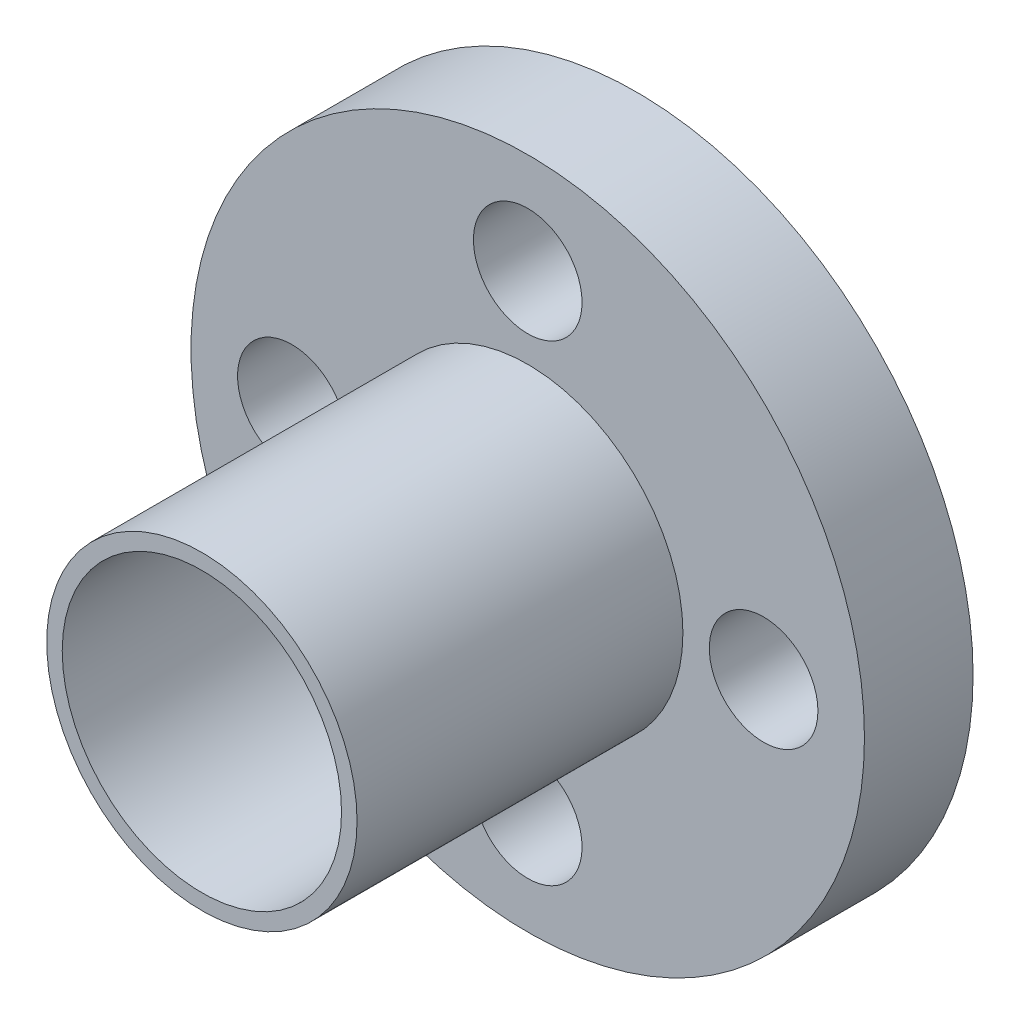
ISO-10303-21;
HEADER;
FILE_DESCRIPTION(('STEP AP214'),'2;1');
FILE_NAME('part.step','',(''),(''),'','','');
FILE_SCHEMA(('AUTOMOTIVE_DESIGN { 1 0 10303 214 1 1 1 1 }'));
ENDSEC;
DATA;
#1=APPLICATION_CONTEXT('core data for automotive mechanical design processes');
#2=APPLICATION_PROTOCOL_DEFINITION('international standard','automotive_design',2000,#1);
#3=PRODUCT_CONTEXT('',#1,'mechanical');
#4=PRODUCT('Part','Part','',(#3));
#5=PRODUCT_RELATED_PRODUCT_CATEGORY('part','',(#4));
#6=PRODUCT_DEFINITION_FORMATION('','',#4);
#7=PRODUCT_DEFINITION_CONTEXT('part definition',#1,'design');
#8=PRODUCT_DEFINITION('design','',#6,#7);
#9=PRODUCT_DEFINITION_SHAPE('','',#8);
#10=(LENGTH_UNIT() NAMED_UNIT(*) SI_UNIT(.MILLI.,.METRE.));
#11=(NAMED_UNIT(*) PLANE_ANGLE_UNIT() SI_UNIT($,.RADIAN.));
#12=(NAMED_UNIT(*) SI_UNIT($,.STERADIAN.) SOLID_ANGLE_UNIT());
#13=UNCERTAINTY_MEASURE_WITH_UNIT(LENGTH_MEASURE(1.E-05),#10,'distance_accuracy_value','');
#14=(GEOMETRIC_REPRESENTATION_CONTEXT(3) GLOBAL_UNCERTAINTY_ASSIGNED_CONTEXT((#13)) GLOBAL_UNIT_ASSIGNED_CONTEXT((#10,
#11,#12)) REPRESENTATION_CONTEXT('',''));
#15=CARTESIAN_POINT('',(0.,0.,0.));
#16=DIRECTION('',(0.,0.,1.));
#17=DIRECTION('',(1.,0.,0.));
#18=AXIS2_PLACEMENT_3D('',#15,#16,#17);
#19=CARTESIAN_POINT('',(0.,0.,15.));
#20=DIRECTION('',(0.,0.,-1.));
#21=DIRECTION('',(-1.,0.,0.));
#22=AXIS2_PLACEMENT_3D('',#19,#20,#21);
#23=CYLINDRICAL_SURFACE('',#22,5.);
#24=CARTESIAN_POINT('',(0.,0.,0.));
#25=DIRECTION('',(0.,0.,1.));
#26=DIRECTION('',(1.,0.,0.));
#27=AXIS2_PLACEMENT_3D('',#24,#25,#26);
#28=CIRCLE('',#27,5.);
#29=CARTESIAN_POINT('',(5.,0.,0.));
#30=VERTEX_POINT('',#29);
#31=EDGE_CURVE('E36',#30,#30,#28,.T.);
#32=ORIENTED_EDGE('',*,*,#31,.T.);
#33=EDGE_LOOP('',(#32));
#34=FACE_BOUND('',#33,.T.);
#35=CARTESIAN_POINT('',(0.,0.,0.999999999999999));
#36=DIRECTION('',(0.,0.,1.));
#37=DIRECTION('',(1.,0.,0.));
#38=AXIS2_PLACEMENT_3D('',#35,#36,#37);
#39=CIRCLE('',#38,5.);
#40=CARTESIAN_POINT('',(5.,0.,0.999999999999999));
#41=VERTEX_POINT('',#40);
#42=EDGE_CURVE('E10',#41,#41,#39,.T.);
#43=ORIENTED_EDGE('',*,*,#42,.F.);
#44=EDGE_LOOP('',(#43));
#45=FACE_BOUND('',#44,.T.);
#46=ADVANCED_FACE('F32',(#34,#45),#23,.T.);
#47=CARTESIAN_POINT('',(0.,0.,0.));
#48=DIRECTION('',(0.,0.,1.));
#49=DIRECTION('',(1.,0.,0.));
#50=AXIS2_PLACEMENT_3D('',#47,#48,#49);
#51=PLANE('',#50);
#52=ORIENTED_EDGE('',*,*,#31,.F.);
#53=EDGE_LOOP('',(#52));
#54=FACE_BOUND('',#53,.T.);
#55=CARTESIAN_POINT('',(0.,0.,0.));
#56=DIRECTION('',(0.,0.,1.));
#57=DIRECTION('',(1.,0.,0.));
#58=AXIS2_PLACEMENT_3D('',#55,#56,#57);
#59=CIRCLE('',#58,4.5);
#60=CARTESIAN_POINT('',(4.5,0.,0.));
#61=VERTEX_POINT('',#60);
#62=EDGE_CURVE('E52',#61,#61,#59,.T.);
#63=ORIENTED_EDGE('',*,*,#62,.T.);
#64=EDGE_LOOP('',(#63));
#65=FACE_BOUND('',#64,.T.);
#66=ADVANCED_FACE('F111',(#54,#65),#51,.F.);
#67=CARTESIAN_POINT('',(0.,0.,0.999999999999999));
#68=DIRECTION('',(0.,0.,1.));
#69=DIRECTION('',(1.,0.,0.));
#70=AXIS2_PLACEMENT_3D('',#67,#68,#69);
#71=CYLINDRICAL_SURFACE('',#70,10.85);
#72=CARTESIAN_POINT('',(0.,0.,0.999999999999999));
#73=DIRECTION('',(0.,0.,1.));
#74=DIRECTION('',(1.,0.,0.));
#75=AXIS2_PLACEMENT_3D('',#72,#73,#74);
#76=CIRCLE('',#75,10.85);
#77=CARTESIAN_POINT('',(10.85,0.,0.999999999999999));
#78=VERTEX_POINT('',#77);
#79=EDGE_CURVE('E57',#78,#78,#76,.T.);
#80=ORIENTED_EDGE('',*,*,#79,.T.);
#81=EDGE_LOOP('',(#80));
#82=FACE_BOUND('',#81,.T.);
#83=CARTESIAN_POINT('',(0.,0.,4.5));
#84=DIRECTION('',(0.,0.,1.));
#85=DIRECTION('',(1.,0.,0.));
#86=AXIS2_PLACEMENT_3D('',#83,#84,#85);
#87=CIRCLE('',#86,10.85);
#88=CARTESIAN_POINT('',(10.85,0.,4.5));
#89=VERTEX_POINT('',#88);
#90=EDGE_CURVE('E61',#89,#89,#87,.T.);
#91=ORIENTED_EDGE('',*,*,#90,.F.);
#92=EDGE_LOOP('',(#91));
#93=FACE_BOUND('',#92,.T.);
#94=ADVANCED_FACE('F109',(#82,#93),#71,.T.);
#95=CARTESIAN_POINT('',(0.,0.,0.999999999999999));
#96=DIRECTION('',(0.,0.,1.));
#97=DIRECTION('',(1.,0.,0.));
#98=AXIS2_PLACEMENT_3D('',#95,#96,#97);
#99=PLANE('',#98);
#100=CARTESIAN_POINT('',(0.,7.6,0.999999999999999));
#101=DIRECTION('',(0.,0.,1.));
#102=DIRECTION('',(1.,0.,0.));
#103=AXIS2_PLACEMENT_3D('',#100,#101,#102);
#104=CIRCLE('',#103,1.75);
#105=CARTESIAN_POINT('',(1.75,7.6,0.999999999999999));
#106=VERTEX_POINT('',#105);
#107=EDGE_CURVE('E66',#106,#106,#104,.T.);
#108=ORIENTED_EDGE('',*,*,#107,.T.);
#109=EDGE_LOOP('',(#108));
#110=FACE_BOUND('',#109,.T.);
#111=CARTESIAN_POINT('',(7.60000000000022,2.15074260103718E-13,0.999999999999999));
#112=DIRECTION('',(0.,0.,1.));
#113=DIRECTION('',(1.,0.,0.));
#114=AXIS2_PLACEMENT_3D('',#111,#112,#113);
#115=CIRCLE('',#114,1.75000000000017);
#116=CARTESIAN_POINT('',(9.35000000000038,2.15074260103718E-13,0.999999999999999));
#117=VERTEX_POINT('',#116);
#118=EDGE_CURVE('E70',#117,#117,#115,.T.);
#119=ORIENTED_EDGE('',*,*,#118,.T.);
#120=EDGE_LOOP('',(#119));
#121=FACE_BOUND('',#120,.T.);
#122=CARTESIAN_POINT('',(4.30148520207437E-13,-7.6,0.999999999999999));
#123=DIRECTION('',(0.,0.,1.));
#124=DIRECTION('',(1.,0.,0.));
#125=AXIS2_PLACEMENT_3D('',#122,#123,#124);
#126=CIRCLE('',#125,1.75000000000046);
#127=CARTESIAN_POINT('',(1.75000000000089,-7.6,0.999999999999999));
#128=VERTEX_POINT('',#127);
#129=EDGE_CURVE('E73',#128,#128,#126,.T.);
#130=ORIENTED_EDGE('',*,*,#129,.T.);
#131=EDGE_LOOP('',(#130));
#132=FACE_BOUND('',#131,.T.);
#133=CARTESIAN_POINT('',(-7.59999999999979,-2.1600499167107E-13,0.999999999999999));
#134=DIRECTION('',(0.,0.,1.));
#135=DIRECTION('',(1.,0.,0.));
#136=AXIS2_PLACEMENT_3D('',#133,#134,#135);
#137=CIRCLE('',#136,1.75000000000035);
#138=CARTESIAN_POINT('',(-5.84999999999944,-2.1600499167107E-13,0.999999999999999));
#139=VERTEX_POINT('',#138);
#140=EDGE_CURVE('E76',#139,#139,#137,.T.);
#141=ORIENTED_EDGE('',*,*,#140,.T.);
#142=EDGE_LOOP('',(#141));
#143=FACE_BOUND('',#142,.T.);
#144=ORIENTED_EDGE('',*,*,#42,.T.);
#145=EDGE_LOOP('',(#144));
#146=FACE_BOUND('',#145,.T.);
#147=ORIENTED_EDGE('',*,*,#79,.F.);
#148=EDGE_LOOP('',(#147));
#149=FACE_BOUND('',#148,.T.);
#150=ADVANCED_FACE('F98',(#110,#121,#132,#143,#146,#149),#99,.F.);
#151=CARTESIAN_POINT('',(0.,0.,4.5));
#152=DIRECTION('',(0.,0.,1.));
#153=DIRECTION('',(1.,0.,0.));
#154=AXIS2_PLACEMENT_3D('',#151,#152,#153);
#155=PLANE('',#154);
#156=CARTESIAN_POINT('',(0.,7.6,4.5));
#157=DIRECTION('',(0.,0.,1.));
#158=DIRECTION('',(1.,0.,0.));
#159=AXIS2_PLACEMENT_3D('',#156,#157,#158);
#160=CIRCLE('',#159,1.75);
#161=CARTESIAN_POINT('',(1.75,7.6,4.5));
#162=VERTEX_POINT('',#161);
#163=EDGE_CURVE('E79',#162,#162,#160,.T.);
#164=ORIENTED_EDGE('',*,*,#163,.F.);
#165=EDGE_LOOP('',(#164));
#166=FACE_BOUND('',#165,.T.);
#167=CARTESIAN_POINT('',(7.60000000000022,2.15074260103718E-13,4.5));
#168=DIRECTION('',(0.,0.,1.));
#169=DIRECTION('',(1.,0.,0.));
#170=AXIS2_PLACEMENT_3D('',#167,#168,#169);
#171=CIRCLE('',#170,1.75000000000017);
#172=CARTESIAN_POINT('',(9.35000000000038,2.15074260103718E-13,4.5));
#173=VERTEX_POINT('',#172);
#174=EDGE_CURVE('E86',#173,#173,#171,.T.);
#175=ORIENTED_EDGE('',*,*,#174,.F.);
#176=EDGE_LOOP('',(#175));
#177=FACE_BOUND('',#176,.T.);
#178=CARTESIAN_POINT('',(4.30148520207437E-13,-7.6,4.5));
#179=DIRECTION('',(0.,0.,1.));
#180=DIRECTION('',(1.,0.,0.));
#181=AXIS2_PLACEMENT_3D('',#178,#179,#180);
#182=CIRCLE('',#181,1.75000000000046);
#183=CARTESIAN_POINT('',(1.75000000000089,-7.6,4.5));
#184=VERTEX_POINT('',#183);
#185=EDGE_CURVE('E83',#184,#184,#182,.T.);
#186=ORIENTED_EDGE('',*,*,#185,.F.);
#187=EDGE_LOOP('',(#186));
#188=FACE_BOUND('',#187,.T.);
#189=CARTESIAN_POINT('',(-7.59999999999979,-2.1600499167107E-13,4.5));
#190=DIRECTION('',(0.,0.,1.));
#191=DIRECTION('',(1.,0.,0.));
#192=AXIS2_PLACEMENT_3D('',#189,#190,#191);
#193=CIRCLE('',#192,1.75000000000035);
#194=CARTESIAN_POINT('',(-5.84999999999944,-2.1600499167107E-13,4.5));
#195=VERTEX_POINT('',#194);
#196=EDGE_CURVE('E80',#195,#195,#193,.T.);
#197=ORIENTED_EDGE('',*,*,#196,.F.);
#198=EDGE_LOOP('',(#197));
#199=FACE_BOUND('',#198,.T.);
#200=CARTESIAN_POINT('',(0.,0.,4.5));
#201=DIRECTION('',(0.,0.,1.));
#202=DIRECTION('',(1.,0.,0.));
#203=AXIS2_PLACEMENT_3D('',#200,#201,#202);
#204=CIRCLE('',#203,5.);
#205=CARTESIAN_POINT('',(5.,0.,4.5));
#206=VERTEX_POINT('',#205);
#207=EDGE_CURVE('E47',#206,#206,#204,.T.);
#208=ORIENTED_EDGE('',*,*,#207,.F.);
#209=EDGE_LOOP('',(#208));
#210=FACE_BOUND('',#209,.T.);
#211=ORIENTED_EDGE('',*,*,#90,.T.);
#212=EDGE_LOOP('',(#211));
#213=FACE_BOUND('',#212,.T.);
#214=ADVANCED_FACE('F95',(#166,#177,#188,#199,#210,#213),#155,.T.);
#215=ORIENTED_EDGE('',*,*,#207,.T.);
#216=EDGE_LOOP('',(#215));
#217=FACE_BOUND('',#216,.T.);
#218=CARTESIAN_POINT('',(0.,0.,15.));
#219=DIRECTION('',(0.,0.,1.));
#220=DIRECTION('',(1.,0.,0.));
#221=AXIS2_PLACEMENT_3D('',#218,#219,#220);
#222=CIRCLE('',#221,5.);
#223=CARTESIAN_POINT('',(5.,0.,15.));
#224=VERTEX_POINT('',#223);
#225=EDGE_CURVE('E40',#224,#224,#222,.T.);
#226=ORIENTED_EDGE('',*,*,#225,.F.);
#227=EDGE_LOOP('',(#226));
#228=FACE_BOUND('',#227,.T.);
#229=ADVANCED_FACE('F34',(#217,#228),#23,.T.);
#230=CARTESIAN_POINT('',(0.,0.,15.));
#231=DIRECTION('',(0.,0.,1.));
#232=DIRECTION('',(1.,0.,0.));
#233=AXIS2_PLACEMENT_3D('',#230,#231,#232);
#234=PLANE('',#233);
#235=ORIENTED_EDGE('',*,*,#225,.T.);
#236=EDGE_LOOP('',(#235));
#237=FACE_BOUND('',#236,.T.);
#238=CARTESIAN_POINT('',(0.,0.,15.));
#239=DIRECTION('',(0.,0.,1.));
#240=DIRECTION('',(1.,0.,0.));
#241=AXIS2_PLACEMENT_3D('',#238,#239,#240);
#242=CIRCLE('',#241,4.5);
#243=CARTESIAN_POINT('',(4.5,0.,15.));
#244=VERTEX_POINT('',#243);
#245=EDGE_CURVE('E49',#244,#244,#242,.T.);
#246=ORIENTED_EDGE('',*,*,#245,.F.);
#247=EDGE_LOOP('',(#246));
#248=FACE_BOUND('',#247,.T.);
#249=ADVANCED_FACE('F128',(#237,#248),#234,.T.);
#250=CARTESIAN_POINT('',(0.,0.,15.));
#251=DIRECTION('',(0.,0.,-1.));
#252=DIRECTION('',(-1.,0.,0.));
#253=AXIS2_PLACEMENT_3D('',#250,#251,#252);
#254=CYLINDRICAL_SURFACE('',#253,4.5);
#255=ORIENTED_EDGE('',*,*,#245,.T.);
#256=EDGE_LOOP('',(#255));
#257=FACE_BOUND('',#256,.T.);
#258=ORIENTED_EDGE('',*,*,#62,.F.);
#259=EDGE_LOOP('',(#258));
#260=FACE_BOUND('',#259,.T.);
#261=ADVANCED_FACE('F132',(#257,#260),#254,.F.);
#262=CARTESIAN_POINT('',(-7.59999999999979,-2.1600499167107E-13,-11.));
#263=DIRECTION('',(0.,0.,1.));
#264=DIRECTION('',(1.,0.,0.));
#265=AXIS2_PLACEMENT_3D('',#262,#263,#264);
#266=CYLINDRICAL_SURFACE('',#265,1.75000000000035);
#267=ORIENTED_EDGE('',*,*,#196,.T.);
#268=EDGE_LOOP('',(#267));
#269=FACE_BOUND('',#268,.T.);
#270=ORIENTED_EDGE('',*,*,#140,.F.);
#271=EDGE_LOOP('',(#270));
#272=FACE_BOUND('',#271,.T.);
#273=ADVANCED_FACE('F142',(#269,#272),#266,.F.);
#274=CARTESIAN_POINT('',(4.30148520207437E-13,-7.6,-11.));
#275=DIRECTION('',(0.,0.,1.));
#276=DIRECTION('',(1.,0.,0.));
#277=AXIS2_PLACEMENT_3D('',#274,#275,#276);
#278=CYLINDRICAL_SURFACE('',#277,1.75000000000046);
#279=ORIENTED_EDGE('',*,*,#185,.T.);
#280=EDGE_LOOP('',(#279));
#281=FACE_BOUND('',#280,.T.);
#282=ORIENTED_EDGE('',*,*,#129,.F.);
#283=EDGE_LOOP('',(#282));
#284=FACE_BOUND('',#283,.T.);
#285=ADVANCED_FACE('F146',(#281,#284),#278,.F.);
#286=CARTESIAN_POINT('',(7.60000000000022,2.15074260103718E-13,-11.));
#287=DIRECTION('',(0.,0.,1.));
#288=DIRECTION('',(1.,0.,0.));
#289=AXIS2_PLACEMENT_3D('',#286,#287,#288);
#290=CYLINDRICAL_SURFACE('',#289,1.75000000000017);
#291=ORIENTED_EDGE('',*,*,#174,.T.);
#292=EDGE_LOOP('',(#291));
#293=FACE_BOUND('',#292,.T.);
#294=ORIENTED_EDGE('',*,*,#118,.F.);
#295=EDGE_LOOP('',(#294));
#296=FACE_BOUND('',#295,.T.);
#297=ADVANCED_FACE('F152',(#293,#296),#290,.F.);
#298=CARTESIAN_POINT('',(0.,7.6,-11.));
#299=DIRECTION('',(0.,0.,1.));
#300=DIRECTION('',(1.,0.,0.));
#301=AXIS2_PLACEMENT_3D('',#298,#299,#300);
#302=CYLINDRICAL_SURFACE('',#301,1.75);
#303=ORIENTED_EDGE('',*,*,#163,.T.);
#304=EDGE_LOOP('',(#303));
#305=FACE_BOUND('',#304,.T.);
#306=ORIENTED_EDGE('',*,*,#107,.F.);
#307=EDGE_LOOP('',(#306));
#308=FACE_BOUND('',#307,.T.);
#309=ADVANCED_FACE('F92',(#305,#308),#302,.F.);
#310=CLOSED_SHELL('',(#46,#66,#94,#150,#214,#229,#249,#261,#273,#285,#297,#309));
#311=MANIFOLD_SOLID_BREP('B2',#310);
#312=ADVANCED_BREP_SHAPE_REPRESENTATION('',(#18,#311),#14);
#313=SHAPE_DEFINITION_REPRESENTATION(#9,#312);
ENDSEC;
END-ISO-10303-21;
